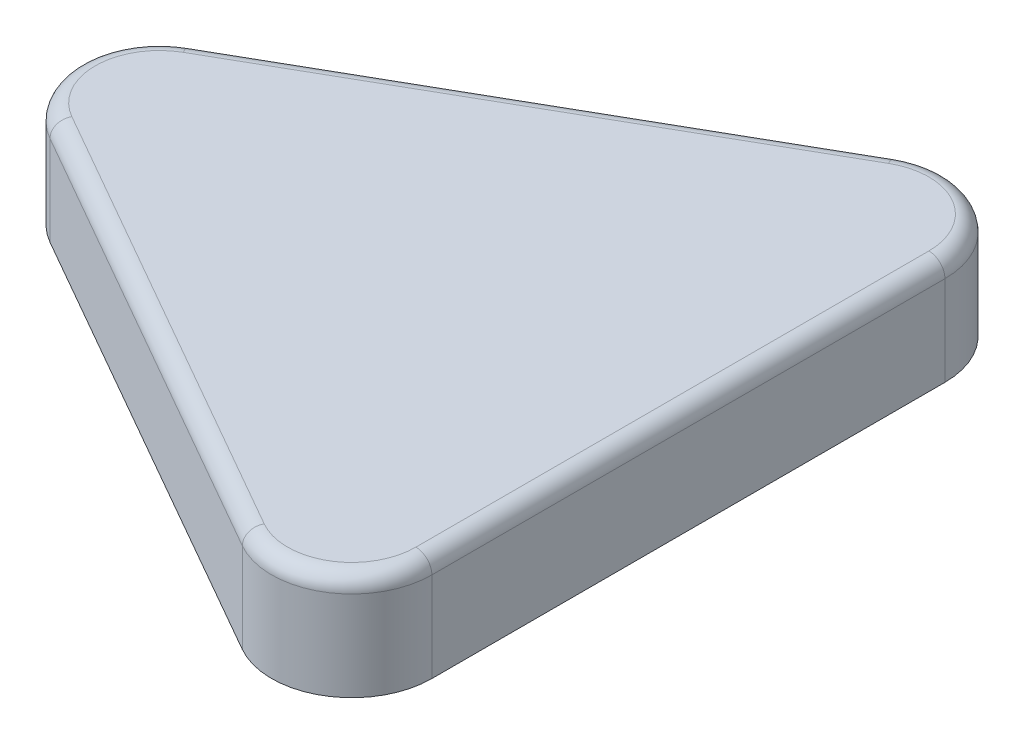
ISO-10303-21;
HEADER;
FILE_DESCRIPTION(('STEP AP214'),'2;1');
FILE_NAME('part.step','',(''),(''),'','','');
FILE_SCHEMA(('AUTOMOTIVE_DESIGN { 1 0 10303 214 1 1 1 1 }'));
ENDSEC;
DATA;
#1=APPLICATION_CONTEXT('core data for automotive mechanical design processes');
#2=APPLICATION_PROTOCOL_DEFINITION('international standard','automotive_design',2000,#1);
#3=PRODUCT_CONTEXT('',#1,'mechanical');
#4=PRODUCT('Part','Part','',(#3));
#5=PRODUCT_RELATED_PRODUCT_CATEGORY('part','',(#4));
#6=PRODUCT_DEFINITION_FORMATION('','',#4);
#7=PRODUCT_DEFINITION_CONTEXT('part definition',#1,'design');
#8=PRODUCT_DEFINITION('design','',#6,#7);
#9=PRODUCT_DEFINITION_SHAPE('','',#8);
#10=(LENGTH_UNIT() NAMED_UNIT(*) SI_UNIT(.MILLI.,.METRE.));
#11=(NAMED_UNIT(*) PLANE_ANGLE_UNIT() SI_UNIT($,.RADIAN.));
#12=(NAMED_UNIT(*) SI_UNIT($,.STERADIAN.) SOLID_ANGLE_UNIT());
#13=UNCERTAINTY_MEASURE_WITH_UNIT(LENGTH_MEASURE(1.E-05),#10,'distance_accuracy_value','');
#14=(GEOMETRIC_REPRESENTATION_CONTEXT(3) GLOBAL_UNCERTAINTY_ASSIGNED_CONTEXT((#13)) GLOBAL_UNIT_ASSIGNED_CONTEXT((#10,
#11,#12)) REPRESENTATION_CONTEXT('',''));
#15=CARTESIAN_POINT('',(0.,0.,0.));
#16=DIRECTION('',(0.,0.,1.));
#17=DIRECTION('',(1.,0.,0.));
#18=AXIS2_PLACEMENT_3D('',#15,#16,#17);
#19=CARTESIAN_POINT('',(0.,1.65,0.));
#20=DIRECTION('',(0.,1.,0.));
#21=DIRECTION('',(0.,0.,1.));
#22=AXIS2_PLACEMENT_3D('',#19,#20,#21);
#23=PLANE('',#22);
#24=DIRECTION('',(0.868243142124459,0.,0.496138938356834));
#25=VECTOR('',#24,1.);
#26=CARTESIAN_POINT('',(-4.01591592961693,1.65,0.856942004261548));
#27=LINE('',#26,#25);
#28=CARTESIAN_POINT('',(3.00386106164142,1.65,4.86824314212346));
#29=VERTEX_POINT('',#28);
#30=CARTESIAN_POINT('',(-3.99613893835454,1.65,0.868243142125769));
#31=VERTEX_POINT('',#30);
#32=EDGE_CURVE('E97',#29,#31,#27,.F.);
#33=ORIENTED_EDGE('',*,*,#32,.F.);
#34=CARTESIAN_POINT('',(3.5,1.65,4.));
#35=DIRECTION('',(0.,-1.,0.));
#36=DIRECTION('',(1.,0.,-1.01654795692241E-11));
#37=AXIS2_PLACEMENT_3D('',#34,#35,#36);
#38=CIRCLE('',#37,1.);
#39=CARTESIAN_POINT('',(4.5,1.65,3.99999999999746));
#40=VERTEX_POINT('',#39);
#41=EDGE_CURVE('E237',#40,#29,#38,.T.);
#42=ORIENTED_EDGE('',*,*,#41,.F.);
#43=DIRECTION('',(0.,0.,-1.));
#44=VECTOR('',#43,1.);
#45=CARTESIAN_POINT('',(4.5,1.65,4.02277817157497));
#46=LINE('',#45,#44);
#47=CARTESIAN_POINT('',(4.5,1.65,-3.99999999999799));
#48=VERTEX_POINT('',#47);
#49=EDGE_CURVE('E223',#48,#40,#46,.F.);
#50=ORIENTED_EDGE('',*,*,#49,.F.);
#51=CARTESIAN_POINT('',(3.5,1.65,-4.));
#52=DIRECTION('',(0.,-1.,0.));
#53=DIRECTION('',(-0.49613893836566,0.,-0.868243142119416));
#54=AXIS2_PLACEMENT_3D('',#51,#52,#53);
#55=CIRCLE('',#54,1.);
#56=CARTESIAN_POINT('',(3.00386106164096,1.65,-4.8682431421232));
#57=VERTEX_POINT('',#56);
#58=EDGE_CURVE('E199',#57,#48,#55,.T.);
#59=ORIENTED_EDGE('',*,*,#58,.F.);
#60=DIRECTION('',(-0.868243142124459,0.,0.496138938356834));
#61=VECTOR('',#60,1.);
#62=CARTESIAN_POINT('',(3.02363805290326,1.65,-4.87954427998737));
#63=LINE('',#62,#61);
#64=CARTESIAN_POINT('',(-3.99613893835323,1.65,-0.868243142126517));
#65=VERTEX_POINT('',#64);
#66=EDGE_CURVE('E100',#65,#57,#63,.F.);
#67=ORIENTED_EDGE('',*,*,#66,.F.);
#68=CARTESIAN_POINT('',(-3.5,1.65,0.));
#69=DIRECTION('',(0.,-1.,0.));
#70=DIRECTION('',(-0.496138938347665,0.,0.868243142129699));
#71=AXIS2_PLACEMENT_3D('',#68,#69,#70);
#72=CIRCLE('',#71,1.);
#73=EDGE_CURVE('E94',#31,#65,#72,.T.);
#74=ORIENTED_EDGE('',*,*,#73,.F.);
#75=EDGE_LOOP('',(#33,#42,#50,#59,#67,#74));
#76=FACE_BOUND('',#75,.T.);
#77=ADVANCED_FACE('F16',(#76),#23,.T.);
#78=CARTESIAN_POINT('',(-3.5,1.4,0.));
#79=DIRECTION('',(0.,1.,0.));
#80=DIRECTION('',(-0.480235849073289,0.,-0.877139401272601));
#81=AXIS2_PLACEMENT_3D('',#78,#79,#80);
#82=TOROIDAL_SURFACE('',#81,1.,0.25);
#83=CARTESIAN_POINT('',(-3.99613893835684,1.4,0.868243142124458));
#84=DIRECTION('',(0.868243142124459,0.,0.496138938356834));
#85=DIRECTION('',(0.496138938356834,0.,-0.868243142124459));
#86=AXIS2_PLACEMENT_3D('',#83,#84,#85);
#87=CIRCLE('',#86,0.25);
#88=CARTESIAN_POINT('',(-4.12017367294604,1.4,1.08530392765557));
#89=VERTEX_POINT('',#88);
#90=EDGE_CURVE('E106',#31,#89,#87,.T.);
#91=ORIENTED_EDGE('',*,*,#90,.F.);
#92=ORIENTED_EDGE('',*,*,#73,.T.);
#93=CARTESIAN_POINT('',(-3.99613893834963,1.4,-0.868243142128577));
#94=DIRECTION('',(-0.868243142124459,0.,0.496138938356834));
#95=DIRECTION('',(0.496138938356834,0.,0.868243142124459));
#96=AXIS2_PLACEMENT_3D('',#93,#94,#95);
#97=CIRCLE('',#96,0.25);
#98=CARTESIAN_POINT('',(-4.12017367294424,1.4,-1.0853039276566));
#99=VERTEX_POINT('',#98);
#100=EDGE_CURVE('E186',#99,#65,#97,.F.);
#101=ORIENTED_EDGE('',*,*,#100,.F.);
#102=CARTESIAN_POINT('',(-3.5,1.4,0.));
#103=DIRECTION('',(0.,1.,0.));
#104=DIRECTION('',(0.,0.,1.));
#105=AXIS2_PLACEMENT_3D('',#102,#103,#104);
#106=CIRCLE('',#105,1.25);
#107=EDGE_CURVE('E59',#89,#99,#106,.F.);
#108=ORIENTED_EDGE('',*,*,#107,.F.);
#109=EDGE_LOOP('',(#91,#92,#101,#108));
#110=FACE_BOUND('',#109,.T.);
#111=ADVANCED_FACE('F115',(#110),#82,.T.);
#112=CARTESIAN_POINT('',(-4.01591592961693,1.4,0.856942004261547));
#113=DIRECTION('',(0.868243142124459,0.,0.496138938356834));
#114=DIRECTION('',(0.496138938356834,0.,-0.868243142124459));
#115=AXIS2_PLACEMENT_3D('',#112,#113,#114);
#116=CYLINDRICAL_SURFACE('',#115,0.25);
#117=CARTESIAN_POINT('',(3.00386106164317,1.4,4.86824314212446));
#118=DIRECTION('',(0.868243142124459,0.,0.496138938356835));
#119=DIRECTION('',(-0.496138938356835,0.,0.868243142124459));
#120=AXIS2_PLACEMENT_3D('',#117,#118,#119);
#121=CIRCLE('',#120,0.25);
#122=CARTESIAN_POINT('',(2.87982632705396,1.4,5.08530392765557));
#123=VERTEX_POINT('',#122);
#124=EDGE_CURVE('E113',#29,#123,#121,.T.);
#125=ORIENTED_EDGE('',*,*,#124,.F.);
#126=ORIENTED_EDGE('',*,*,#32,.T.);
#127=ORIENTED_EDGE('',*,*,#90,.T.);
#128=DIRECTION('',(0.868243142124459,0.,0.496138938356834));
#129=VECTOR('',#128,1.);
#130=CARTESIAN_POINT('',(-4.12017367294604,1.4,1.08530392765557));
#131=LINE('',#130,#129);
#132=EDGE_CURVE('E176',#123,#89,#131,.F.);
#133=ORIENTED_EDGE('',*,*,#132,.F.);
#134=EDGE_LOOP('',(#125,#126,#127,#133));
#135=FACE_BOUND('',#134,.T.);
#136=ADVANCED_FACE('F111',(#135),#116,.T.);
#137=CARTESIAN_POINT('',(3.5,1.4,4.));
#138=DIRECTION('',(0.,1.,0.));
#139=DIRECTION('',(-0.511877283874571,0.,0.859058581386154));
#140=AXIS2_PLACEMENT_3D('',#137,#138,#139);
#141=TOROIDAL_SURFACE('',#140,1.,0.25);
#142=CARTESIAN_POINT('',(4.5,1.4,4.));
#143=DIRECTION('',(0.,0.,-1.));
#144=DIRECTION('',(-1.,0.,0.));
#145=AXIS2_PLACEMENT_3D('',#142,#143,#144);
#146=CIRCLE('',#145,0.25);
#147=CARTESIAN_POINT('',(4.75,1.4,4.));
#148=VERTEX_POINT('',#147);
#149=EDGE_CURVE('E231',#40,#148,#146,.T.);
#150=ORIENTED_EDGE('',*,*,#149,.F.);
#151=ORIENTED_EDGE('',*,*,#41,.T.);
#152=ORIENTED_EDGE('',*,*,#124,.T.);
#153=CARTESIAN_POINT('',(3.5,1.4,4.));
#154=DIRECTION('',(0.,1.,0.));
#155=DIRECTION('',(0.,0.,1.));
#156=AXIS2_PLACEMENT_3D('',#153,#154,#155);
#157=CIRCLE('',#156,1.25);
#158=EDGE_CURVE('E171',#148,#123,#157,.F.);
#159=ORIENTED_EDGE('',*,*,#158,.F.);
#160=EDGE_LOOP('',(#150,#151,#152,#159));
#161=FACE_BOUND('',#160,.T.);
#162=ADVANCED_FACE('F240',(#161),#141,.T.);
#163=CARTESIAN_POINT('',(4.5,1.4,4.02277817157497));
#164=DIRECTION('',(0.,0.,-1.));
#165=DIRECTION('',(-1.,0.,0.));
#166=AXIS2_PLACEMENT_3D('',#163,#164,#165);
#167=CYLINDRICAL_SURFACE('',#166,0.25);
#168=CARTESIAN_POINT('',(4.5,1.4,-4.));
#169=DIRECTION('',(0.,0.,-1.));
#170=DIRECTION('',(1.,0.,0.));
#171=AXIS2_PLACEMENT_3D('',#168,#169,#170);
#172=CIRCLE('',#171,0.25);
#173=CARTESIAN_POINT('',(4.75,1.4,-4.));
#174=VERTEX_POINT('',#173);
#175=EDGE_CURVE('E204',#48,#174,#172,.T.);
#176=ORIENTED_EDGE('',*,*,#175,.F.);
#177=ORIENTED_EDGE('',*,*,#49,.T.);
#178=ORIENTED_EDGE('',*,*,#149,.T.);
#179=DIRECTION('',(0.,0.,-1.));
#180=VECTOR('',#179,1.);
#181=CARTESIAN_POINT('',(4.75,1.4,4.));
#182=LINE('',#181,#180);
#183=EDGE_CURVE('E166',#174,#148,#182,.F.);
#184=ORIENTED_EDGE('',*,*,#183,.F.);
#185=EDGE_LOOP('',(#176,#177,#178,#184));
#186=FACE_BOUND('',#185,.T.);
#187=ADVANCED_FACE('F213',(#186),#167,.T.);
#188=CARTESIAN_POINT('',(3.5,1.4,-4.));
#189=DIRECTION('',(0.,1.,0.));
#190=DIRECTION('',(0.999833974162204,0.,0.0182215287781373));
#191=AXIS2_PLACEMENT_3D('',#188,#189,#190);
#192=TOROIDAL_SURFACE('',#191,1.,0.25);
#193=CARTESIAN_POINT('',(3.00386106164317,1.4,-4.86824314212446));
#194=DIRECTION('',(-0.868243142124459,0.,0.496138938356834));
#195=DIRECTION('',(0.496138938356834,0.,0.868243142124459));
#196=AXIS2_PLACEMENT_3D('',#193,#194,#195);
#197=CIRCLE('',#196,0.25);
#198=CARTESIAN_POINT('',(2.87982632705396,1.4,-5.08530392765558));
#199=VERTEX_POINT('',#198);
#200=EDGE_CURVE('E188',#57,#199,#197,.T.);
#201=ORIENTED_EDGE('',*,*,#200,.F.);
#202=ORIENTED_EDGE('',*,*,#58,.T.);
#203=ORIENTED_EDGE('',*,*,#175,.T.);
#204=CARTESIAN_POINT('',(3.5,1.4,-4.));
#205=DIRECTION('',(0.,1.,0.));
#206=DIRECTION('',(0.,0.,1.));
#207=AXIS2_PLACEMENT_3D('',#204,#205,#206);
#208=CIRCLE('',#207,1.25);
#209=EDGE_CURVE('E158',#199,#174,#208,.F.);
#210=ORIENTED_EDGE('',*,*,#209,.F.);
#211=EDGE_LOOP('',(#201,#202,#203,#210));
#212=FACE_BOUND('',#211,.T.);
#213=ADVANCED_FACE('F207',(#212),#192,.T.);
#214=CARTESIAN_POINT('',(3.02363805290326,1.4,-4.87954427998737));
#215=DIRECTION('',(-0.868243142124459,0.,0.496138938356834));
#216=DIRECTION('',(0.496138938356834,0.,0.868243142124459));
#217=AXIS2_PLACEMENT_3D('',#214,#215,#216);
#218=CYLINDRICAL_SURFACE('',#217,0.25);
#219=ORIENTED_EDGE('',*,*,#100,.T.);
#220=ORIENTED_EDGE('',*,*,#66,.T.);
#221=ORIENTED_EDGE('',*,*,#200,.T.);
#222=DIRECTION('',(-0.868243142124459,0.,0.496138938356834));
#223=VECTOR('',#222,1.);
#224=CARTESIAN_POINT('',(2.87982632705396,1.4,-5.08530392765558));
#225=LINE('',#224,#223);
#226=EDGE_CURVE('E154',#99,#199,#225,.F.);
#227=ORIENTED_EDGE('',*,*,#226,.F.);
#228=EDGE_LOOP('',(#219,#220,#221,#227));
#229=FACE_BOUND('',#228,.T.);
#230=ADVANCED_FACE('F212',(#229),#218,.T.);
#231=CARTESIAN_POINT('',(-3.5,0.,0.));
#232=DIRECTION('',(0.,1.,0.));
#233=DIRECTION('',(0.,0.,1.));
#234=AXIS2_PLACEMENT_3D('',#231,#232,#233);
#235=CYLINDRICAL_SURFACE('',#234,1.25);
#236=DIRECTION('',(0.,1.,0.));
#237=VECTOR('',#236,1.);
#238=CARTESIAN_POINT('',(-4.12017367294604,0.,1.08530392765557));
#239=LINE('',#238,#237);
#240=CARTESIAN_POINT('',(-4.12017367294604,0.,1.08530392765557));
#241=VERTEX_POINT('',#240);
#242=EDGE_CURVE('E179',#89,#241,#239,.F.);
#243=ORIENTED_EDGE('',*,*,#242,.F.);
#244=ORIENTED_EDGE('',*,*,#107,.T.);
#245=DIRECTION('',(0.,1.,0.));
#246=VECTOR('',#245,1.);
#247=CARTESIAN_POINT('',(-4.12017367294604,0.,-1.08530392765557));
#248=LINE('',#247,#246);
#249=CARTESIAN_POINT('',(-4.12017367294604,0.,-1.08530392765557));
#250=VERTEX_POINT('',#249);
#251=EDGE_CURVE('E157',#250,#99,#248,.T.);
#252=ORIENTED_EDGE('',*,*,#251,.F.);
#253=CARTESIAN_POINT('',(-3.5,0.,0.));
#254=DIRECTION('',(0.,1.,0.));
#255=DIRECTION('',(0.,0.,1.));
#256=AXIS2_PLACEMENT_3D('',#253,#254,#255);
#257=CIRCLE('',#256,1.25);
#258=EDGE_CURVE('E20',#250,#241,#257,.T.);
#259=ORIENTED_EDGE('',*,*,#258,.T.);
#260=EDGE_LOOP('',(#243,#244,#252,#259));
#261=FACE_BOUND('',#260,.T.);
#262=ADVANCED_FACE('F258',(#261),#235,.T.);
#263=CARTESIAN_POINT('',(-4.12017367294604,0.,1.08530392765557));
#264=DIRECTION('',(-0.496138938356834,0.,0.868243142124459));
#265=DIRECTION('',(0.868243142124459,0.,0.496138938356834));
#266=AXIS2_PLACEMENT_3D('',#263,#264,#265);
#267=PLANE('',#266);
#268=DIRECTION('',(0.,1.,0.));
#269=VECTOR('',#268,1.);
#270=CARTESIAN_POINT('',(2.87982632705396,0.,5.08530392765557));
#271=LINE('',#270,#269);
#272=CARTESIAN_POINT('',(2.87982632705396,0.,5.08530392765558));
#273=VERTEX_POINT('',#272);
#274=EDGE_CURVE('E174',#123,#273,#271,.F.);
#275=ORIENTED_EDGE('',*,*,#274,.F.);
#276=ORIENTED_EDGE('',*,*,#132,.T.);
#277=ORIENTED_EDGE('',*,*,#242,.T.);
#278=DIRECTION('',(0.868243142124459,0.,0.496138938356834));
#279=VECTOR('',#278,1.);
#280=CARTESIAN_POINT('',(-4.12017367294604,0.,1.08530392765557));
#281=LINE('',#280,#279);
#282=EDGE_CURVE('E144',#241,#273,#281,.T.);
#283=ORIENTED_EDGE('',*,*,#282,.T.);
#284=EDGE_LOOP('',(#275,#276,#277,#283));
#285=FACE_BOUND('',#284,.T.);
#286=ADVANCED_FACE('F256',(#285),#267,.T.);
#287=CARTESIAN_POINT('',(3.5,0.,4.));
#288=DIRECTION('',(0.,1.,0.));
#289=DIRECTION('',(0.,0.,1.));
#290=AXIS2_PLACEMENT_3D('',#287,#288,#289);
#291=CYLINDRICAL_SURFACE('',#290,1.25);
#292=DIRECTION('',(0.,1.,0.));
#293=VECTOR('',#292,1.);
#294=CARTESIAN_POINT('',(4.75,0.,4.));
#295=LINE('',#294,#293);
#296=CARTESIAN_POINT('',(4.75,0.,4.));
#297=VERTEX_POINT('',#296);
#298=EDGE_CURVE('E169',#148,#297,#295,.F.);
#299=ORIENTED_EDGE('',*,*,#298,.F.);
#300=ORIENTED_EDGE('',*,*,#158,.T.);
#301=ORIENTED_EDGE('',*,*,#274,.T.);
#302=CARTESIAN_POINT('',(3.5,0.,4.));
#303=DIRECTION('',(0.,1.,0.));
#304=DIRECTION('',(0.,0.,1.));
#305=AXIS2_PLACEMENT_3D('',#302,#303,#304);
#306=CIRCLE('',#305,1.25);
#307=EDGE_CURVE('E142',#273,#297,#306,.T.);
#308=ORIENTED_EDGE('',*,*,#307,.T.);
#309=EDGE_LOOP('',(#299,#300,#301,#308));
#310=FACE_BOUND('',#309,.T.);
#311=ADVANCED_FACE('F271',(#310),#291,.T.);
#312=CARTESIAN_POINT('',(4.75,0.,4.));
#313=DIRECTION('',(1.,0.,0.));
#314=DIRECTION('',(0.,0.,-1.));
#315=AXIS2_PLACEMENT_3D('',#312,#313,#314);
#316=PLANE('',#315);
#317=DIRECTION('',(0.,1.,0.));
#318=VECTOR('',#317,1.);
#319=CARTESIAN_POINT('',(4.75,0.,-4.));
#320=LINE('',#319,#318);
#321=CARTESIAN_POINT('',(4.75,0.,-4.));
#322=VERTEX_POINT('',#321);
#323=EDGE_CURVE('E164',#174,#322,#320,.F.);
#324=ORIENTED_EDGE('',*,*,#323,.F.);
#325=ORIENTED_EDGE('',*,*,#183,.T.);
#326=ORIENTED_EDGE('',*,*,#298,.T.);
#327=DIRECTION('',(0.,0.,1.));
#328=VECTOR('',#327,1.);
#329=CARTESIAN_POINT('',(4.75,0.,0.));
#330=LINE('',#329,#328);
#331=EDGE_CURVE('E141',#297,#322,#330,.F.);
#332=ORIENTED_EDGE('',*,*,#331,.T.);
#333=EDGE_LOOP('',(#324,#325,#326,#332));
#334=FACE_BOUND('',#333,.T.);
#335=ADVANCED_FACE('F269',(#334),#316,.T.);
#336=CARTESIAN_POINT('',(3.5,0.,-4.));
#337=DIRECTION('',(0.,1.,0.));
#338=DIRECTION('',(0.,0.,1.));
#339=AXIS2_PLACEMENT_3D('',#336,#337,#338);
#340=CYLINDRICAL_SURFACE('',#339,1.25);
#341=DIRECTION('',(0.,1.,0.));
#342=VECTOR('',#341,1.);
#343=CARTESIAN_POINT('',(2.87982632705396,0.,-5.08530392765558));
#344=LINE('',#343,#342);
#345=CARTESIAN_POINT('',(2.87982632705396,0.,-5.08530392765558));
#346=VERTEX_POINT('',#345);
#347=EDGE_CURVE('E34',#199,#346,#344,.F.);
#348=ORIENTED_EDGE('',*,*,#347,.F.);
#349=ORIENTED_EDGE('',*,*,#209,.T.);
#350=ORIENTED_EDGE('',*,*,#323,.T.);
#351=CARTESIAN_POINT('',(3.5,0.,-4.));
#352=DIRECTION('',(0.,1.,0.));
#353=DIRECTION('',(0.,0.,1.));
#354=AXIS2_PLACEMENT_3D('',#351,#352,#353);
#355=CIRCLE('',#354,1.25);
#356=EDGE_CURVE('E26',#322,#346,#355,.T.);
#357=ORIENTED_EDGE('',*,*,#356,.T.);
#358=EDGE_LOOP('',(#348,#349,#350,#357));
#359=FACE_BOUND('',#358,.T.);
#360=ADVANCED_FACE('F264',(#359),#340,.T.);
#361=CARTESIAN_POINT('',(2.87982632705396,0.,-5.08530392765558));
#362=DIRECTION('',(-0.496138938356834,0.,-0.868243142124459));
#363=DIRECTION('',(-0.868243142124459,0.,0.496138938356834));
#364=AXIS2_PLACEMENT_3D('',#361,#362,#363);
#365=PLANE('',#364);
#366=ORIENTED_EDGE('',*,*,#251,.T.);
#367=ORIENTED_EDGE('',*,*,#226,.T.);
#368=ORIENTED_EDGE('',*,*,#347,.T.);
#369=DIRECTION('',(-0.868243142124459,0.,0.496138938356834));
#370=VECTOR('',#369,1.);
#371=CARTESIAN_POINT('',(2.87982632705396,0.,-5.08530392765558));
#372=LINE('',#371,#370);
#373=EDGE_CURVE('E11',#346,#250,#372,.T.);
#374=ORIENTED_EDGE('',*,*,#373,.T.);
#375=EDGE_LOOP('',(#366,#367,#368,#374));
#376=FACE_BOUND('',#375,.T.);
#377=ADVANCED_FACE('F259',(#376),#365,.T.);
#378=CARTESIAN_POINT('',(0.,0.,0.));
#379=DIRECTION('',(0.,1.,0.));
#380=DIRECTION('',(0.,0.,1.));
#381=AXIS2_PLACEMENT_3D('',#378,#379,#380);
#382=PLANE('',#381);
#383=ORIENTED_EDGE('',*,*,#356,.F.);
#384=ORIENTED_EDGE('',*,*,#331,.F.);
#385=ORIENTED_EDGE('',*,*,#307,.F.);
#386=ORIENTED_EDGE('',*,*,#282,.F.);
#387=ORIENTED_EDGE('',*,*,#258,.F.);
#388=ORIENTED_EDGE('',*,*,#373,.F.);
#389=EDGE_LOOP('',(#383,#384,#385,#386,#387,#388));
#390=FACE_BOUND('',#389,.T.);
#391=ADVANCED_FACE('F261',(#390),#382,.F.);
#392=CLOSED_SHELL('',(#77,#111,#136,#162,#187,#213,#230,#262,#286,#311,#335,#360,#377,#391));
#393=MANIFOLD_SOLID_BREP('B1',#392);
#394=ADVANCED_BREP_SHAPE_REPRESENTATION('',(#18,#393),#14);
#395=SHAPE_DEFINITION_REPRESENTATION(#9,#394);
ENDSEC;
END-ISO-10303-21;
